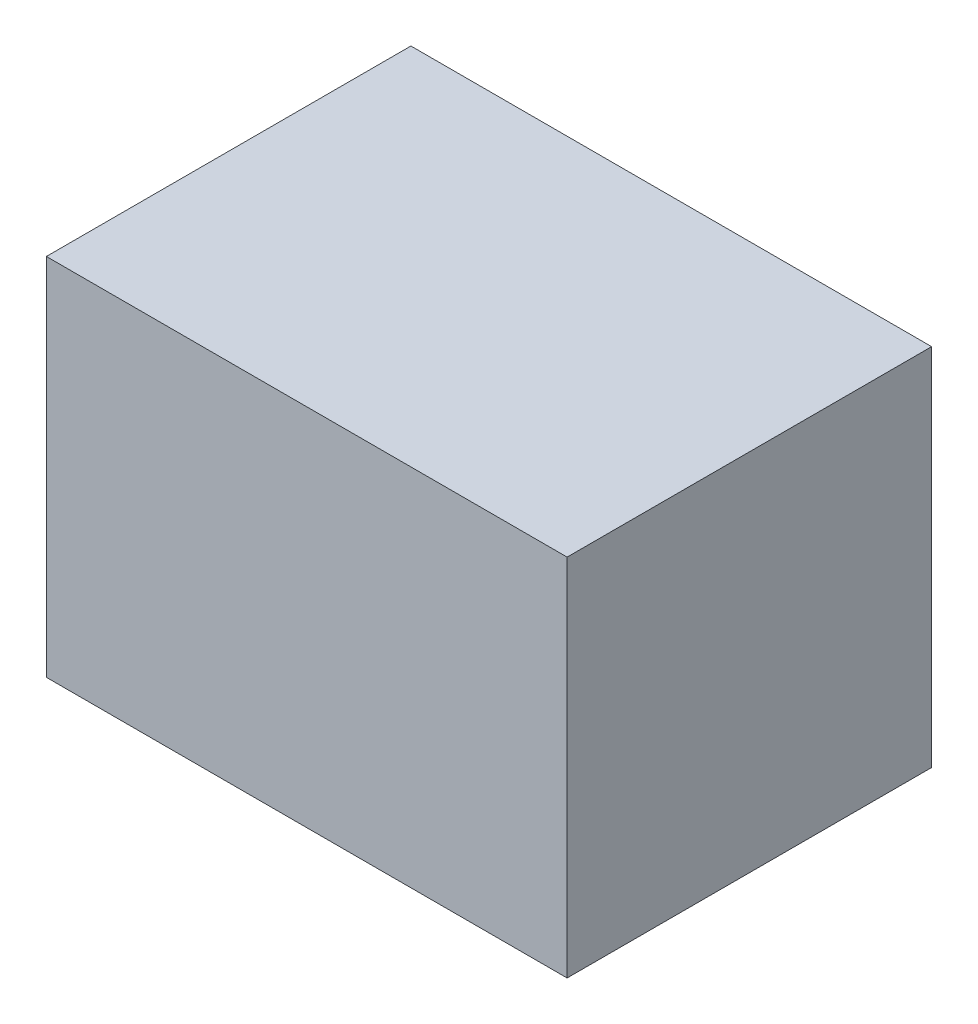
ISO-10303-21;
HEADER;
FILE_DESCRIPTION(('STEP AP214'),'2;1');
FILE_NAME('part.step','',(''),(''),'','','');
FILE_SCHEMA(('AUTOMOTIVE_DESIGN { 1 0 10303 214 1 1 1 1 }'));
ENDSEC;
DATA;
#1=APPLICATION_CONTEXT('core data for automotive mechanical design processes');
#2=APPLICATION_PROTOCOL_DEFINITION('international standard','automotive_design',2000,#1);
#3=PRODUCT_CONTEXT('',#1,'mechanical');
#4=PRODUCT('Part','Part','',(#3));
#5=PRODUCT_RELATED_PRODUCT_CATEGORY('part','',(#4));
#6=PRODUCT_DEFINITION_FORMATION('','',#4);
#7=PRODUCT_DEFINITION_CONTEXT('part definition',#1,'design');
#8=PRODUCT_DEFINITION('design','',#6,#7);
#9=PRODUCT_DEFINITION_SHAPE('','',#8);
#10=(LENGTH_UNIT() NAMED_UNIT(*) SI_UNIT(.MILLI.,.METRE.));
#11=(NAMED_UNIT(*) PLANE_ANGLE_UNIT() SI_UNIT($,.RADIAN.));
#12=(NAMED_UNIT(*) SI_UNIT($,.STERADIAN.) SOLID_ANGLE_UNIT());
#13=UNCERTAINTY_MEASURE_WITH_UNIT(LENGTH_MEASURE(1.E-05),#10,'distance_accuracy_value','');
#14=(GEOMETRIC_REPRESENTATION_CONTEXT(3) GLOBAL_UNCERTAINTY_ASSIGNED_CONTEXT((#13)) GLOBAL_UNIT_ASSIGNED_CONTEXT((#10,
#11,#12)) REPRESENTATION_CONTEXT('',''));
#15=CARTESIAN_POINT('',(0.,0.,0.));
#16=DIRECTION('',(0.,0.,1.));
#17=DIRECTION('',(1.,0.,0.));
#18=AXIS2_PLACEMENT_3D('',#15,#16,#17);
#19=CARTESIAN_POINT('',(-5.08,0.,0.));
#20=DIRECTION('',(0.,-1.,0.));
#21=DIRECTION('',(0.,0.,-1.));
#22=AXIS2_PLACEMENT_3D('',#19,#20,#21);
#23=PLANE('',#22);
#24=DIRECTION('',(1.,0.,0.));
#25=VECTOR('',#24,1.);
#26=CARTESIAN_POINT('',(-5.08,0.,-1.1));
#27=LINE('',#26,#25);
#28=CARTESIAN_POINT('',(9.91,0.,-1.1));
#29=VERTEX_POINT('',#28);
#30=CARTESIAN_POINT('',(10.41,0.,-1.1));
#31=VERTEX_POINT('',#30);
#32=EDGE_CURVE('E126',#29,#31,#27,.T.);
#33=ORIENTED_EDGE('',*,*,#32,.F.);
#34=DIRECTION('',(0.,0.,1.));
#35=VECTOR('',#34,1.);
#36=CARTESIAN_POINT('',(9.91,0.,0.));
#37=LINE('',#36,#35);
#38=CARTESIAN_POINT('',(9.91,0.,-0.75));
#39=VERTEX_POINT('',#38);
#40=EDGE_CURVE('E27',#29,#39,#37,.T.);
#41=ORIENTED_EDGE('',*,*,#40,.T.);
#42=DIRECTION('',(1.,0.,0.));
#43=VECTOR('',#42,1.);
#44=CARTESIAN_POINT('',(-5.08,0.,-0.75));
#45=LINE('',#44,#43);
#46=CARTESIAN_POINT('',(10.41,0.,-0.75));
#47=VERTEX_POINT('',#46);
#48=EDGE_CURVE('E84',#39,#47,#45,.T.);
#49=ORIENTED_EDGE('',*,*,#48,.T.);
#50=DIRECTION('',(0.,0.,1.));
#51=VECTOR('',#50,1.);
#52=CARTESIAN_POINT('',(10.41,0.,0.));
#53=LINE('',#52,#51);
#54=EDGE_CURVE('E62',#31,#47,#53,.T.);
#55=ORIENTED_EDGE('',*,*,#54,.F.);
#56=EDGE_LOOP('',(#33,#41,#49,#55));
#57=FACE_BOUND('',#56,.T.);
#58=ADVANCED_FACE('F16',(#57),#23,.F.);
#59=CARTESIAN_POINT('',(-5.08,-0.35,0.));
#60=DIRECTION('',(0.,-1.,0.));
#61=DIRECTION('',(0.,0.,-1.));
#62=AXIS2_PLACEMENT_3D('',#59,#60,#61);
#63=PLANE('',#62);
#64=DIRECTION('',(1.,0.,0.));
#65=VECTOR('',#64,1.);
#66=CARTESIAN_POINT('',(-5.08,-0.35,-1.1));
#67=LINE('',#66,#65);
#68=CARTESIAN_POINT('',(9.91,-0.35,-1.1));
#69=VERTEX_POINT('',#68);
#70=CARTESIAN_POINT('',(10.41,-0.35,-1.1));
#71=VERTEX_POINT('',#70);
#72=EDGE_CURVE('E97',#69,#71,#67,.T.);
#73=ORIENTED_EDGE('',*,*,#72,.T.);
#74=DIRECTION('',(0.,0.,1.));
#75=VECTOR('',#74,1.);
#76=CARTESIAN_POINT('',(10.41,-0.35,0.));
#77=LINE('',#76,#75);
#78=CARTESIAN_POINT('',(10.41,-0.35,-0.75));
#79=VERTEX_POINT('',#78);
#80=EDGE_CURVE('E71',#71,#79,#77,.T.);
#81=ORIENTED_EDGE('',*,*,#80,.T.);
#82=DIRECTION('',(1.,0.,0.));
#83=VECTOR('',#82,1.);
#84=CARTESIAN_POINT('',(-5.08,-0.35,-0.75));
#85=LINE('',#84,#83);
#86=CARTESIAN_POINT('',(9.91,-0.35,-0.75));
#87=VERTEX_POINT('',#86);
#88=EDGE_CURVE('E91',#87,#79,#85,.T.);
#89=ORIENTED_EDGE('',*,*,#88,.F.);
#90=DIRECTION('',(0.,0.,1.));
#91=VECTOR('',#90,1.);
#92=CARTESIAN_POINT('',(9.91,-0.35,0.));
#93=LINE('',#92,#91);
#94=EDGE_CURVE('E11',#69,#87,#93,.T.);
#95=ORIENTED_EDGE('',*,*,#94,.F.);
#96=EDGE_LOOP('',(#73,#81,#89,#95));
#97=FACE_BOUND('',#96,.T.);
#98=ADVANCED_FACE('F95',(#97),#63,.T.);
#99=CARTESIAN_POINT('',(9.91,-0.35,0.));
#100=DIRECTION('',(-1.,0.,0.));
#101=DIRECTION('',(0.,0.,1.));
#102=AXIS2_PLACEMENT_3D('',#99,#100,#101);
#103=PLANE('',#102);
#104=ORIENTED_EDGE('',*,*,#40,.F.);
#105=DIRECTION('',(0.,1.,0.));
#106=VECTOR('',#105,1.);
#107=CARTESIAN_POINT('',(9.91,-0.35,-1.1));
#108=LINE('',#107,#106);
#109=EDGE_CURVE('E106',#69,#29,#108,.T.);
#110=ORIENTED_EDGE('',*,*,#109,.F.);
#111=ORIENTED_EDGE('',*,*,#94,.T.);
#112=DIRECTION('',(0.,1.,0.));
#113=VECTOR('',#112,1.);
#114=CARTESIAN_POINT('',(9.91,-0.35,-0.75));
#115=LINE('',#114,#113);
#116=EDGE_CURVE('E92',#87,#39,#115,.T.);
#117=ORIENTED_EDGE('',*,*,#116,.T.);
#118=EDGE_LOOP('',(#104,#110,#111,#117));
#119=FACE_BOUND('',#118,.T.);
#120=ADVANCED_FACE('F120',(#119),#103,.T.);
#121=CARTESIAN_POINT('',(-5.08,-0.35,-0.75));
#122=DIRECTION('',(0.,0.,1.));
#123=DIRECTION('',(1.,0.,0.));
#124=AXIS2_PLACEMENT_3D('',#121,#122,#123);
#125=PLANE('',#124);
#126=ORIENTED_EDGE('',*,*,#48,.F.);
#127=ORIENTED_EDGE('',*,*,#116,.F.);
#128=ORIENTED_EDGE('',*,*,#88,.T.);
#129=DIRECTION('',(0.,1.,0.));
#130=VECTOR('',#129,1.);
#131=CARTESIAN_POINT('',(10.41,-0.35,-0.75));
#132=LINE('',#131,#130);
#133=EDGE_CURVE('E20',#79,#47,#132,.T.);
#134=ORIENTED_EDGE('',*,*,#133,.T.);
#135=EDGE_LOOP('',(#126,#127,#128,#134));
#136=FACE_BOUND('',#135,.T.);
#137=ADVANCED_FACE('F18',(#136),#125,.T.);
#138=CARTESIAN_POINT('',(10.41,-0.35,0.));
#139=DIRECTION('',(-1.,0.,0.));
#140=DIRECTION('',(0.,0.,1.));
#141=AXIS2_PLACEMENT_3D('',#138,#139,#140);
#142=PLANE('',#141);
#143=ORIENTED_EDGE('',*,*,#54,.T.);
#144=ORIENTED_EDGE('',*,*,#133,.F.);
#145=ORIENTED_EDGE('',*,*,#80,.F.);
#146=DIRECTION('',(0.,1.,0.));
#147=VECTOR('',#146,1.);
#148=CARTESIAN_POINT('',(10.41,-0.35,-1.1));
#149=LINE('',#148,#147);
#150=EDGE_CURVE('E128',#71,#31,#149,.T.);
#151=ORIENTED_EDGE('',*,*,#150,.T.);
#152=EDGE_LOOP('',(#143,#144,#145,#151));
#153=FACE_BOUND('',#152,.T.);
#154=ADVANCED_FACE('F100',(#153),#142,.F.);
#155=CARTESIAN_POINT('',(-5.08,-0.35,-1.1));
#156=DIRECTION('',(0.,0.,1.));
#157=DIRECTION('',(1.,0.,0.));
#158=AXIS2_PLACEMENT_3D('',#155,#156,#157);
#159=PLANE('',#158);
#160=ORIENTED_EDGE('',*,*,#32,.T.);
#161=ORIENTED_EDGE('',*,*,#150,.F.);
#162=ORIENTED_EDGE('',*,*,#72,.F.);
#163=ORIENTED_EDGE('',*,*,#109,.T.);
#164=EDGE_LOOP('',(#160,#161,#162,#163));
#165=FACE_BOUND('',#164,.T.);
#166=ADVANCED_FACE('F125',(#165),#159,.F.);
#167=CLOSED_SHELL('',(#58,#98,#120,#137,#154,#166));
#168=MANIFOLD_SOLID_BREP('B1',#167);
#169=ADVANCED_BREP_SHAPE_REPRESENTATION('',(#18,#168),#14);
#170=SHAPE_DEFINITION_REPRESENTATION(#9,#169);
ENDSEC;
END-ISO-10303-21;
